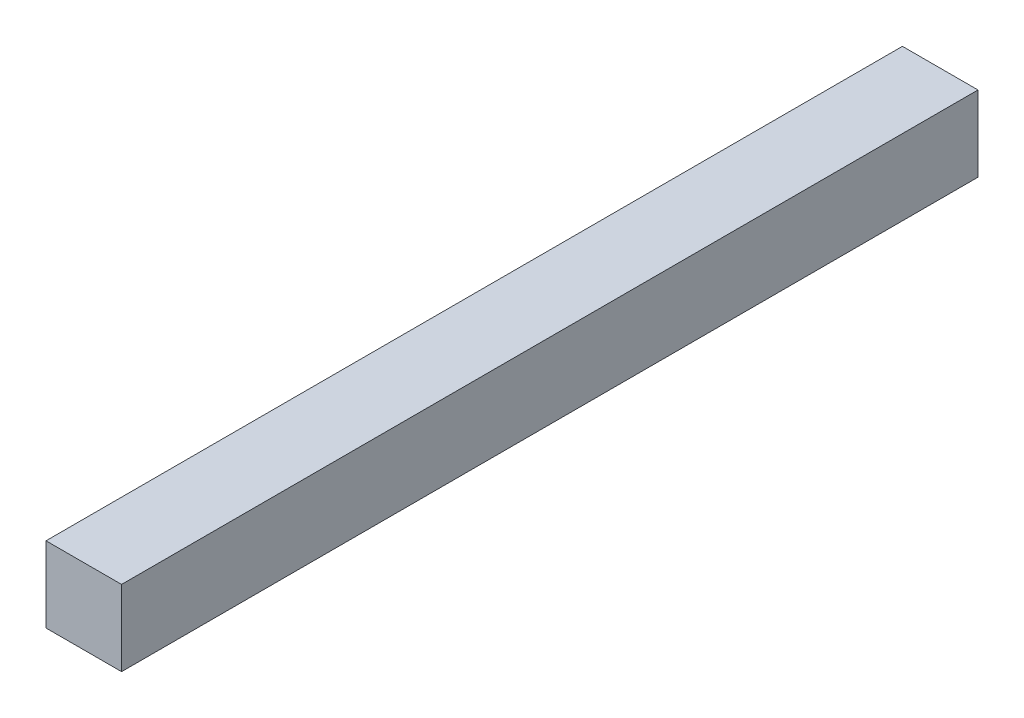
ISO-10303-21;
HEADER;
FILE_DESCRIPTION(('STEP AP214'),'2;1');
FILE_NAME('part.step','',(''),(''),'','','');
FILE_SCHEMA(('AUTOMOTIVE_DESIGN { 1 0 10303 214 1 1 1 1 }'));
ENDSEC;
DATA;
#1=APPLICATION_CONTEXT('core data for automotive mechanical design processes');
#2=APPLICATION_PROTOCOL_DEFINITION('international standard','automotive_design',2000,#1);
#3=PRODUCT_CONTEXT('',#1,'mechanical');
#4=PRODUCT('Part','Part','',(#3));
#5=PRODUCT_RELATED_PRODUCT_CATEGORY('part','',(#4));
#6=PRODUCT_DEFINITION_FORMATION('','',#4);
#7=PRODUCT_DEFINITION_CONTEXT('part definition',#1,'design');
#8=PRODUCT_DEFINITION('design','',#6,#7);
#9=PRODUCT_DEFINITION_SHAPE('','',#8);
#10=(LENGTH_UNIT() NAMED_UNIT(*) SI_UNIT(.MILLI.,.METRE.));
#11=(NAMED_UNIT(*) PLANE_ANGLE_UNIT() SI_UNIT($,.RADIAN.));
#12=(NAMED_UNIT(*) SI_UNIT($,.STERADIAN.) SOLID_ANGLE_UNIT());
#13=UNCERTAINTY_MEASURE_WITH_UNIT(LENGTH_MEASURE(1.E-05),#10,'distance_accuracy_value','');
#14=(GEOMETRIC_REPRESENTATION_CONTEXT(3) GLOBAL_UNCERTAINTY_ASSIGNED_CONTEXT((#13)) GLOBAL_UNIT_ASSIGNED_CONTEXT((#10,
#11,#12)) REPRESENTATION_CONTEXT('',''));
#15=CARTESIAN_POINT('',(0.,0.,0.));
#16=DIRECTION('',(0.,0.,1.));
#17=DIRECTION('',(1.,0.,0.));
#18=AXIS2_PLACEMENT_3D('',#15,#16,#17);
#19=CARTESIAN_POINT('',(7.5,-7.5,170.));
#20=DIRECTION('',(-1.,0.,0.));
#21=DIRECTION('',(0.,0.,1.));
#22=AXIS2_PLACEMENT_3D('',#19,#20,#21);
#23=PLANE('',#22);
#24=DIRECTION('',(0.,1.,0.));
#25=VECTOR('',#24,1.);
#26=CARTESIAN_POINT('',(7.5,-7.5,0.));
#27=LINE('',#26,#25);
#28=CARTESIAN_POINT('',(7.5,-7.5,0.));
#29=VERTEX_POINT('',#28);
#30=CARTESIAN_POINT('',(7.5,7.5,0.));
#31=VERTEX_POINT('',#30);
#32=EDGE_CURVE('E98',#29,#31,#27,.T.);
#33=ORIENTED_EDGE('',*,*,#32,.T.);
#34=DIRECTION('',(0.,0.,-1.));
#35=VECTOR('',#34,1.);
#36=CARTESIAN_POINT('',(7.5,7.5,170.));
#37=LINE('',#36,#35);
#38=CARTESIAN_POINT('',(7.5,7.5,170.));
#39=VERTEX_POINT('',#38);
#40=EDGE_CURVE('E11',#39,#31,#37,.T.);
#41=ORIENTED_EDGE('',*,*,#40,.F.);
#42=DIRECTION('',(0.,1.,0.));
#43=VECTOR('',#42,1.);
#44=CARTESIAN_POINT('',(7.5,-7.5,170.));
#45=LINE('',#44,#43);
#46=CARTESIAN_POINT('',(7.5,-7.5,170.));
#47=VERTEX_POINT('',#46);
#48=EDGE_CURVE('E86',#47,#39,#45,.T.);
#49=ORIENTED_EDGE('',*,*,#48,.F.);
#50=DIRECTION('',(0.,0.,-1.));
#51=VECTOR('',#50,1.);
#52=CARTESIAN_POINT('',(7.5,-7.5,170.));
#53=LINE('',#52,#51);
#54=EDGE_CURVE('E94',#47,#29,#53,.T.);
#55=ORIENTED_EDGE('',*,*,#54,.T.);
#56=EDGE_LOOP('',(#33,#41,#49,#55));
#57=FACE_BOUND('',#56,.T.);
#58=ADVANCED_FACE('F35',(#57),#23,.F.);
#59=CARTESIAN_POINT('',(-7.5,7.5,170.));
#60=DIRECTION('',(0.,-1.,0.));
#61=DIRECTION('',(0.,0.,-1.));
#62=AXIS2_PLACEMENT_3D('',#59,#60,#61);
#63=PLANE('',#62);
#64=DIRECTION('',(-1.,0.,0.));
#65=VECTOR('',#64,1.);
#66=CARTESIAN_POINT('',(-7.5,7.5,0.));
#67=LINE('',#66,#65);
#68=CARTESIAN_POINT('',(-7.5,7.5,0.));
#69=VERTEX_POINT('',#68);
#70=EDGE_CURVE('E90',#31,#69,#67,.T.);
#71=ORIENTED_EDGE('',*,*,#70,.T.);
#72=DIRECTION('',(0.,0.,-1.));
#73=VECTOR('',#72,1.);
#74=CARTESIAN_POINT('',(-7.5,7.5,170.));
#75=LINE('',#74,#73);
#76=CARTESIAN_POINT('',(-7.5,7.5,170.));
#77=VERTEX_POINT('',#76);
#78=EDGE_CURVE('E43',#77,#69,#75,.T.);
#79=ORIENTED_EDGE('',*,*,#78,.F.);
#80=DIRECTION('',(-1.,0.,0.));
#81=VECTOR('',#80,1.);
#82=CARTESIAN_POINT('',(-7.5,7.5,170.));
#83=LINE('',#82,#81);
#84=EDGE_CURVE('E81',#39,#77,#83,.T.);
#85=ORIENTED_EDGE('',*,*,#84,.F.);
#86=ORIENTED_EDGE('',*,*,#40,.T.);
#87=EDGE_LOOP('',(#71,#79,#85,#86));
#88=FACE_BOUND('',#87,.T.);
#89=ADVANCED_FACE('F89',(#88),#63,.F.);
#90=CARTESIAN_POINT('',(-7.5,-7.5,170.));
#91=DIRECTION('',(1.,0.,0.));
#92=DIRECTION('',(0.,0.,-1.));
#93=AXIS2_PLACEMENT_3D('',#90,#91,#92);
#94=PLANE('',#93);
#95=DIRECTION('',(0.,-1.,0.));
#96=VECTOR('',#95,1.);
#97=CARTESIAN_POINT('',(-7.5,-7.5,0.));
#98=LINE('',#97,#96);
#99=CARTESIAN_POINT('',(-7.5,-7.5,0.));
#100=VERTEX_POINT('',#99);
#101=EDGE_CURVE('E68',#69,#100,#98,.T.);
#102=ORIENTED_EDGE('',*,*,#101,.T.);
#103=DIRECTION('',(0.,0.,-1.));
#104=VECTOR('',#103,1.);
#105=CARTESIAN_POINT('',(-7.5,-7.5,170.));
#106=LINE('',#105,#104);
#107=CARTESIAN_POINT('',(-7.5,-7.5,170.));
#108=VERTEX_POINT('',#107);
#109=EDGE_CURVE('E91',#108,#100,#106,.T.);
#110=ORIENTED_EDGE('',*,*,#109,.F.);
#111=DIRECTION('',(0.,-1.,0.));
#112=VECTOR('',#111,1.);
#113=CARTESIAN_POINT('',(-7.5,-7.5,170.));
#114=LINE('',#113,#112);
#115=EDGE_CURVE('E84',#77,#108,#114,.T.);
#116=ORIENTED_EDGE('',*,*,#115,.F.);
#117=ORIENTED_EDGE('',*,*,#78,.T.);
#118=EDGE_LOOP('',(#102,#110,#116,#117));
#119=FACE_BOUND('',#118,.T.);
#120=ADVANCED_FACE('F92',(#119),#94,.F.);
#121=CARTESIAN_POINT('',(-7.5,-7.5,170.));
#122=DIRECTION('',(0.,1.,0.));
#123=DIRECTION('',(0.,0.,1.));
#124=AXIS2_PLACEMENT_3D('',#121,#122,#123);
#125=PLANE('',#124);
#126=DIRECTION('',(1.,0.,0.));
#127=VECTOR('',#126,1.);
#128=CARTESIAN_POINT('',(-7.5,-7.5,0.));
#129=LINE('',#128,#127);
#130=EDGE_CURVE('E74',#100,#29,#129,.T.);
#131=ORIENTED_EDGE('',*,*,#130,.T.);
#132=ORIENTED_EDGE('',*,*,#54,.F.);
#133=DIRECTION('',(1.,0.,0.));
#134=VECTOR('',#133,1.);
#135=CARTESIAN_POINT('',(-7.5,-7.5,170.));
#136=LINE('',#135,#134);
#137=EDGE_CURVE('E51',#108,#47,#136,.T.);
#138=ORIENTED_EDGE('',*,*,#137,.F.);
#139=ORIENTED_EDGE('',*,*,#109,.T.);
#140=EDGE_LOOP('',(#131,#132,#138,#139));
#141=FACE_BOUND('',#140,.T.);
#142=ADVANCED_FACE('F105',(#141),#125,.F.);
#143=CARTESIAN_POINT('',(0.,0.,170.));
#144=DIRECTION('',(0.,0.,-1.));
#145=DIRECTION('',(-1.,0.,0.));
#146=AXIS2_PLACEMENT_3D('',#143,#144,#145);
#147=PLANE('',#146);
#148=ORIENTED_EDGE('',*,*,#48,.T.);
#149=ORIENTED_EDGE('',*,*,#84,.T.);
#150=ORIENTED_EDGE('',*,*,#115,.T.);
#151=ORIENTED_EDGE('',*,*,#137,.T.);
#152=EDGE_LOOP('',(#148,#149,#150,#151));
#153=FACE_BOUND('',#152,.T.);
#154=ADVANCED_FACE('F82',(#153),#147,.F.);
#155=CARTESIAN_POINT('',(0.,0.,0.));
#156=DIRECTION('',(0.,0.,-1.));
#157=DIRECTION('',(-1.,0.,0.));
#158=AXIS2_PLACEMENT_3D('',#155,#156,#157);
#159=PLANE('',#158);
#160=ORIENTED_EDGE('',*,*,#32,.F.);
#161=ORIENTED_EDGE('',*,*,#130,.F.);
#162=ORIENTED_EDGE('',*,*,#101,.F.);
#163=ORIENTED_EDGE('',*,*,#70,.F.);
#164=EDGE_LOOP('',(#160,#161,#162,#163));
#165=FACE_BOUND('',#164,.T.);
#166=ADVANCED_FACE('F108',(#165),#159,.T.);
#167=CLOSED_SHELL('',(#58,#89,#120,#142,#154,#166));
#168=MANIFOLD_SOLID_BREP('B2',#167);
#169=ADVANCED_BREP_SHAPE_REPRESENTATION('',(#18,#168),#14);
#170=SHAPE_DEFINITION_REPRESENTATION(#9,#169);
ENDSEC;
END-ISO-10303-21;
